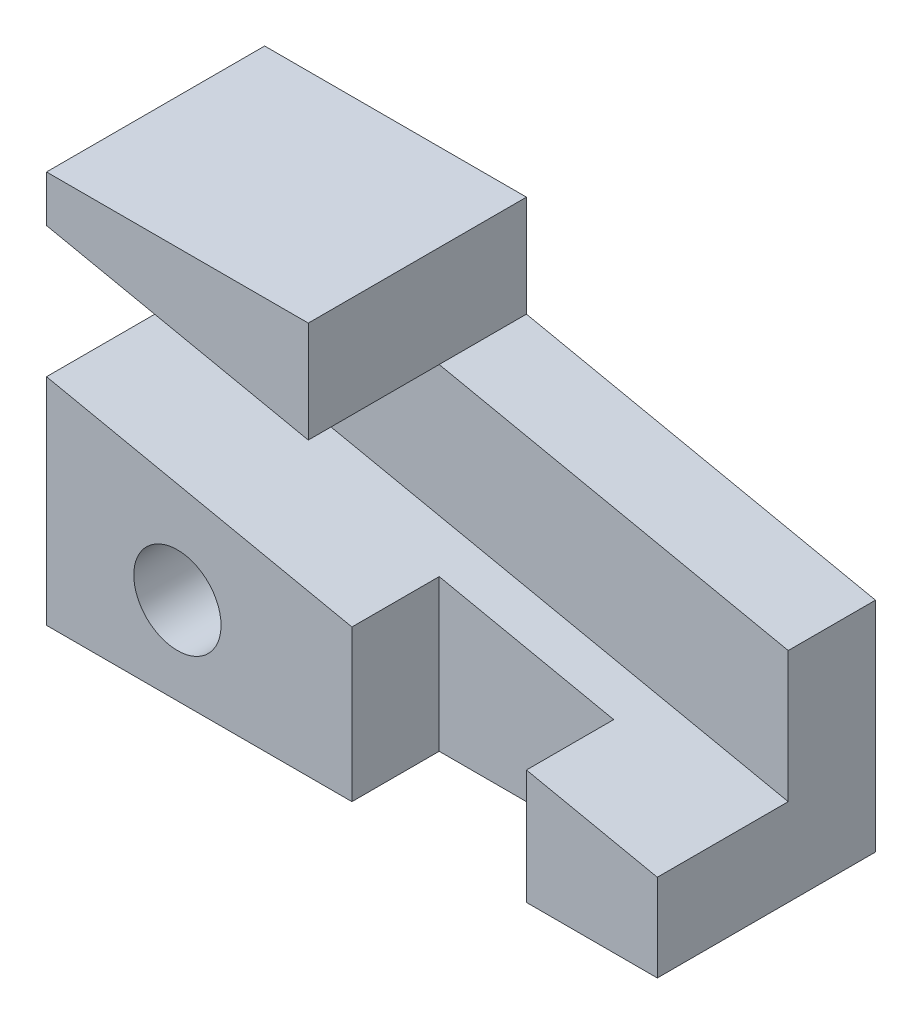
ISO-10303-21;
HEADER;
FILE_DESCRIPTION(('STEP AP214'),'2;1');
FILE_NAME('part.step','',(''),(''),'','','');
FILE_SCHEMA(('AUTOMOTIVE_DESIGN { 1 0 10303 214 1 1 1 1 }'));
ENDSEC;
DATA;
#1=APPLICATION_CONTEXT('core data for automotive mechanical design processes');
#2=APPLICATION_PROTOCOL_DEFINITION('international standard','automotive_design',2000,#1);
#3=PRODUCT_CONTEXT('',#1,'mechanical');
#4=PRODUCT('Part','Part','',(#3));
#5=PRODUCT_RELATED_PRODUCT_CATEGORY('part','',(#4));
#6=PRODUCT_DEFINITION_FORMATION('','',#4);
#7=PRODUCT_DEFINITION_CONTEXT('part definition',#1,'design');
#8=PRODUCT_DEFINITION('design','',#6,#7);
#9=PRODUCT_DEFINITION_SHAPE('','',#8);
#10=(LENGTH_UNIT() NAMED_UNIT(*) SI_UNIT(.MILLI.,.METRE.));
#11=(NAMED_UNIT(*) PLANE_ANGLE_UNIT() SI_UNIT($,.RADIAN.));
#12=(NAMED_UNIT(*) SI_UNIT($,.STERADIAN.) SOLID_ANGLE_UNIT());
#13=UNCERTAINTY_MEASURE_WITH_UNIT(LENGTH_MEASURE(1.E-05),#10,'distance_accuracy_value','');
#14=(GEOMETRIC_REPRESENTATION_CONTEXT(3) GLOBAL_UNCERTAINTY_ASSIGNED_CONTEXT((#13)) GLOBAL_UNIT_ASSIGNED_CONTEXT((#10,
#11,#12)) REPRESENTATION_CONTEXT('',''));
#15=CARTESIAN_POINT('',(0.,0.,0.));
#16=DIRECTION('',(0.,0.,1.));
#17=DIRECTION('',(1.,0.,0.));
#18=AXIS2_PLACEMENT_3D('',#15,#16,#17);
#19=CARTESIAN_POINT('',(0.,45.,0.));
#20=DIRECTION('',(0.,0.,-1.));
#21=DIRECTION('',(-1.,0.,0.));
#22=AXIS2_PLACEMENT_3D('',#19,#20,#21);
#23=PLANE('',#22);
#24=CARTESIAN_POINT('',(15.,10.,0.));
#25=DIRECTION('',(0.,0.,1.));
#26=DIRECTION('',(1.,0.,0.));
#27=AXIS2_PLACEMENT_3D('',#24,#25,#26);
#28=CIRCLE('',#27,5.);
#29=CARTESIAN_POINT('',(20.,10.,0.));
#30=VERTEX_POINT('',#29);
#31=EDGE_CURVE('E465',#30,#30,#28,.T.);
#32=ORIENTED_EDGE('',*,*,#31,.F.);
#33=EDGE_LOOP('',(#32));
#34=FACE_BOUND('',#33,.T.);
#35=DIRECTION('',(1.,0.,0.));
#36=VECTOR('',#35,1.);
#37=CARTESIAN_POINT('',(0.,0.,0.));
#38=LINE('',#37,#36);
#39=CARTESIAN_POINT('',(0.,0.,0.));
#40=VERTEX_POINT('',#39);
#41=CARTESIAN_POINT('',(35.,0.,0.));
#42=VERTEX_POINT('',#41);
#43=EDGE_CURVE('E249',#40,#42,#38,.T.);
#44=ORIENTED_EDGE('',*,*,#43,.T.);
#45=DIRECTION('',(0.,-1.,0.));
#46=VECTOR('',#45,1.);
#47=CARTESIAN_POINT('',(35.,45.,0.));
#48=LINE('',#47,#46);
#49=CARTESIAN_POINT('',(35.,17.3389476948148,0.));
#50=VERTEX_POINT('',#49);
#51=EDGE_CURVE('E152',#50,#42,#48,.T.);
#52=ORIENTED_EDGE('',*,*,#51,.F.);
#53=DIRECTION('',(0.978715612915179,-0.205221219750946,0.));
#54=VECTOR('',#53,1.);
#55=CARTESIAN_POINT('',(0.,24.6778953896296,0.));
#56=LINE('',#55,#54);
#57=CARTESIAN_POINT('',(0.,24.6778953896296,0.));
#58=VERTEX_POINT('',#57);
#59=EDGE_CURVE('E217',#58,#50,#56,.T.);
#60=ORIENTED_EDGE('',*,*,#59,.F.);
#61=DIRECTION('',(0.,-1.,0.));
#62=VECTOR('',#61,1.);
#63=CARTESIAN_POINT('',(0.,45.,0.));
#64=LINE('',#63,#62);
#65=EDGE_CURVE('E268',#58,#40,#64,.T.);
#66=ORIENTED_EDGE('',*,*,#65,.T.);
#67=EDGE_LOOP('',(#44,#52,#60,#66));
#68=FACE_BOUND('',#67,.T.);
#69=ADVANCED_FACE('F39',(#34,#68),#23,.F.);
#70=DIRECTION('',(-0.978715612915179,0.205221219750946,0.));
#71=VECTOR('',#70,1.);
#72=CARTESIAN_POINT('',(70.,25.,0.));
#73=LINE('',#72,#71);
#74=CARTESIAN_POINT('',(30.,33.3873687940741,0.));
#75=VERTEX_POINT('',#74);
#76=CARTESIAN_POINT('',(0.,39.6778953896296,0.));
#77=VERTEX_POINT('',#76);
#78=EDGE_CURVE('E191',#75,#77,#73,.T.);
#79=ORIENTED_EDGE('',*,*,#78,.F.);
#80=DIRECTION('',(0.,-1.,0.));
#81=VECTOR('',#80,1.);
#82=CARTESIAN_POINT('',(30.,45.,0.));
#83=LINE('',#82,#81);
#84=CARTESIAN_POINT('',(30.,45.,0.));
#85=VERTEX_POINT('',#84);
#86=EDGE_CURVE('E169',#85,#75,#83,.T.);
#87=ORIENTED_EDGE('',*,*,#86,.F.);
#88=DIRECTION('',(1.,0.,0.));
#89=VECTOR('',#88,1.);
#90=CARTESIAN_POINT('',(0.,45.,0.));
#91=LINE('',#90,#89);
#92=CARTESIAN_POINT('',(0.,45.,0.));
#93=VERTEX_POINT('',#92);
#94=EDGE_CURVE('E236',#93,#85,#91,.T.);
#95=ORIENTED_EDGE('',*,*,#94,.F.);
#96=EDGE_CURVE('E269',#93,#77,#64,.T.);
#97=ORIENTED_EDGE('',*,*,#96,.T.);
#98=EDGE_LOOP('',(#79,#87,#95,#97));
#99=FACE_BOUND('',#98,.T.);
#100=ADVANCED_FACE('F296',(#99),#23,.F.);
#101=CARTESIAN_POINT('',(0.,45.,0.));
#102=DIRECTION('',(1.,0.,0.));
#103=DIRECTION('',(0.,0.,-1.));
#104=AXIS2_PLACEMENT_3D('',#101,#102,#103);
#105=PLANE('',#104);
#106=DIRECTION('',(0.,-1.,0.));
#107=VECTOR('',#106,1.);
#108=CARTESIAN_POINT('',(0.,39.6778953896296,-15.));
#109=LINE('',#108,#107);
#110=CARTESIAN_POINT('',(0.,39.6778953896296,-15.));
#111=VERTEX_POINT('',#110);
#112=CARTESIAN_POINT('',(0.,24.6778953896296,-15.));
#113=VERTEX_POINT('',#112);
#114=EDGE_CURVE('E201',#111,#113,#109,.T.);
#115=ORIENTED_EDGE('',*,*,#114,.F.);
#116=DIRECTION('',(0.,0.,1.));
#117=VECTOR('',#116,1.);
#118=CARTESIAN_POINT('',(0.,39.6778953896296,-15.));
#119=LINE('',#118,#117);
#120=EDGE_CURVE('E213',#111,#77,#119,.T.);
#121=ORIENTED_EDGE('',*,*,#120,.T.);
#122=ORIENTED_EDGE('',*,*,#96,.F.);
#123=DIRECTION('',(0.,0.,1.));
#124=VECTOR('',#123,1.);
#125=CARTESIAN_POINT('',(0.,45.,0.));
#126=LINE('',#125,#124);
#127=CARTESIAN_POINT('',(0.,45.,-25.));
#128=VERTEX_POINT('',#127);
#129=EDGE_CURVE('E232',#128,#93,#126,.T.);
#130=ORIENTED_EDGE('',*,*,#129,.F.);
#131=DIRECTION('',(0.,-1.,0.));
#132=VECTOR('',#131,1.);
#133=CARTESIAN_POINT('',(0.,45.,-25.));
#134=LINE('',#133,#132);
#135=CARTESIAN_POINT('',(0.,0.,-25.));
#136=VERTEX_POINT('',#135);
#137=EDGE_CURVE('E244',#128,#136,#134,.T.);
#138=ORIENTED_EDGE('',*,*,#137,.T.);
#139=DIRECTION('',(0.,0.,1.));
#140=VECTOR('',#139,1.);
#141=CARTESIAN_POINT('',(0.,0.,0.));
#142=LINE('',#141,#140);
#143=EDGE_CURVE('E225',#136,#40,#142,.T.);
#144=ORIENTED_EDGE('',*,*,#143,.T.);
#145=ORIENTED_EDGE('',*,*,#65,.F.);
#146=DIRECTION('',(0.,0.,1.));
#147=VECTOR('',#146,1.);
#148=CARTESIAN_POINT('',(0.,24.6778953896296,-15.));
#149=LINE('',#148,#147);
#150=EDGE_CURVE('E226',#113,#58,#149,.T.);
#151=ORIENTED_EDGE('',*,*,#150,.F.);
#152=EDGE_LOOP('',(#115,#121,#122,#130,#138,#144,#145,#151));
#153=FACE_BOUND('',#152,.T.);
#154=ADVANCED_FACE('F41',(#153),#105,.F.);
#155=CARTESIAN_POINT('',(55.,13.1452632977778,0.));
#156=VERTEX_POINT('',#155);
#157=CARTESIAN_POINT('',(70.,10.,0.));
#158=VERTEX_POINT('',#157);
#159=EDGE_CURVE('E216',#156,#158,#56,.T.);
#160=ORIENTED_EDGE('',*,*,#159,.F.);
#161=DIRECTION('',(0.,-1.,0.));
#162=VECTOR('',#161,1.);
#163=CARTESIAN_POINT('',(55.,45.,0.));
#164=LINE('',#163,#162);
#165=CARTESIAN_POINT('',(55.,0.,0.));
#166=VERTEX_POINT('',#165);
#167=EDGE_CURVE('E170',#156,#166,#164,.T.);
#168=ORIENTED_EDGE('',*,*,#167,.T.);
#169=CARTESIAN_POINT('',(70.,0.,0.));
#170=VERTEX_POINT('',#169);
#171=EDGE_CURVE('E248',#166,#170,#38,.T.);
#172=ORIENTED_EDGE('',*,*,#171,.T.);
#173=DIRECTION('',(0.,-1.,0.));
#174=VECTOR('',#173,1.);
#175=CARTESIAN_POINT('',(70.,45.,0.));
#176=LINE('',#175,#174);
#177=EDGE_CURVE('E264',#158,#170,#176,.T.);
#178=ORIENTED_EDGE('',*,*,#177,.F.);
#179=EDGE_LOOP('',(#160,#168,#172,#178));
#180=FACE_BOUND('',#179,.T.);
#181=ADVANCED_FACE('F283',(#180),#23,.F.);
#182=CARTESIAN_POINT('',(70.,45.,0.));
#183=DIRECTION('',(-1.,0.,0.));
#184=DIRECTION('',(0.,0.,1.));
#185=AXIS2_PLACEMENT_3D('',#182,#183,#184);
#186=PLANE('',#185);
#187=DIRECTION('',(0.,-1.,0.));
#188=VECTOR('',#187,1.);
#189=CARTESIAN_POINT('',(70.,45.,-25.));
#190=LINE('',#189,#188);
#191=CARTESIAN_POINT('',(70.,25.,-25.));
#192=VERTEX_POINT('',#191);
#193=CARTESIAN_POINT('',(70.,0.,-25.));
#194=VERTEX_POINT('',#193);
#195=EDGE_CURVE('E261',#192,#194,#190,.T.);
#196=ORIENTED_EDGE('',*,*,#195,.F.);
#197=DIRECTION('',(0.,0.,1.));
#198=VECTOR('',#197,1.);
#199=CARTESIAN_POINT('',(70.,25.,-25.));
#200=LINE('',#199,#198);
#201=CARTESIAN_POINT('',(70.,25.,-15.));
#202=VERTEX_POINT('',#201);
#203=EDGE_CURVE('E187',#192,#202,#200,.T.);
#204=ORIENTED_EDGE('',*,*,#203,.T.);
#205=DIRECTION('',(0.,1.,0.));
#206=VECTOR('',#205,1.);
#207=CARTESIAN_POINT('',(70.,10.,-15.));
#208=LINE('',#207,#206);
#209=CARTESIAN_POINT('',(70.,10.,-15.));
#210=VERTEX_POINT('',#209);
#211=EDGE_CURVE('E209',#210,#202,#208,.T.);
#212=ORIENTED_EDGE('',*,*,#211,.F.);
#213=DIRECTION('',(0.,0.,1.));
#214=VECTOR('',#213,1.);
#215=CARTESIAN_POINT('',(70.,10.,-15.));
#216=LINE('',#215,#214);
#217=EDGE_CURVE('E221',#210,#158,#216,.T.);
#218=ORIENTED_EDGE('',*,*,#217,.T.);
#219=ORIENTED_EDGE('',*,*,#177,.T.);
#220=DIRECTION('',(0.,0.,-1.));
#221=VECTOR('',#220,1.);
#222=CARTESIAN_POINT('',(70.,0.,0.));
#223=LINE('',#222,#221);
#224=EDGE_CURVE('E252',#170,#194,#223,.T.);
#225=ORIENTED_EDGE('',*,*,#224,.T.);
#226=EDGE_LOOP('',(#196,#204,#212,#218,#219,#225));
#227=FACE_BOUND('',#226,.T.);
#228=ADVANCED_FACE('F318',(#227),#186,.F.);
#229=CARTESIAN_POINT('',(0.,45.,-25.));
#230=DIRECTION('',(0.,0.,1.));
#231=DIRECTION('',(1.,0.,0.));
#232=AXIS2_PLACEMENT_3D('',#229,#230,#231);
#233=PLANE('',#232);
#234=CARTESIAN_POINT('',(15.,10.,-25.));
#235=DIRECTION('',(0.,0.,1.));
#236=DIRECTION('',(1.,0.,0.));
#237=AXIS2_PLACEMENT_3D('',#234,#235,#236);
#238=CIRCLE('',#237,5.);
#239=CARTESIAN_POINT('',(20.,10.,-25.));
#240=VERTEX_POINT('',#239);
#241=EDGE_CURVE('E157',#240,#240,#238,.T.);
#242=ORIENTED_EDGE('',*,*,#241,.T.);
#243=EDGE_LOOP('',(#242));
#244=FACE_BOUND('',#243,.T.);
#245=DIRECTION('',(0.,-1.,0.));
#246=VECTOR('',#245,1.);
#247=CARTESIAN_POINT('',(30.,45.,-25.));
#248=LINE('',#247,#246);
#249=CARTESIAN_POINT('',(30.,45.,-25.));
#250=VERTEX_POINT('',#249);
#251=CARTESIAN_POINT('',(30.,33.3873687940741,-25.));
#252=VERTEX_POINT('',#251);
#253=EDGE_CURVE('E176',#250,#252,#248,.T.);
#254=ORIENTED_EDGE('',*,*,#253,.T.);
#255=DIRECTION('',(0.978715612915179,-0.205221219750946,0.));
#256=VECTOR('',#255,1.);
#257=CARTESIAN_POINT('',(30.,33.3873687940741,-25.));
#258=LINE('',#257,#256);
#259=EDGE_CURVE('E180',#252,#192,#258,.T.);
#260=ORIENTED_EDGE('',*,*,#259,.T.);
#261=ORIENTED_EDGE('',*,*,#195,.T.);
#262=DIRECTION('',(-1.,0.,0.));
#263=VECTOR('',#262,1.);
#264=CARTESIAN_POINT('',(0.,0.,-25.));
#265=LINE('',#264,#263);
#266=EDGE_CURVE('E237',#194,#136,#265,.T.);
#267=ORIENTED_EDGE('',*,*,#266,.T.);
#268=ORIENTED_EDGE('',*,*,#137,.F.);
#269=DIRECTION('',(-1.,0.,0.));
#270=VECTOR('',#269,1.);
#271=CARTESIAN_POINT('',(0.,45.,-25.));
#272=LINE('',#271,#270);
#273=EDGE_CURVE('E241',#250,#128,#272,.T.);
#274=ORIENTED_EDGE('',*,*,#273,.F.);
#275=EDGE_LOOP('',(#254,#260,#261,#267,#268,#274));
#276=FACE_BOUND('',#275,.T.);
#277=ADVANCED_FACE('F314',(#244,#276),#233,.F.);
#278=CARTESIAN_POINT('',(0.,45.,0.));
#279=DIRECTION('',(0.,-1.,0.));
#280=DIRECTION('',(0.,0.,-1.));
#281=AXIS2_PLACEMENT_3D('',#278,#279,#280);
#282=PLANE('',#281);
#283=ORIENTED_EDGE('',*,*,#94,.T.);
#284=DIRECTION('',(0.,0.,1.));
#285=VECTOR('',#284,1.);
#286=CARTESIAN_POINT('',(30.,45.,-25.));
#287=LINE('',#286,#285);
#288=EDGE_CURVE('E184',#250,#85,#287,.T.);
#289=ORIENTED_EDGE('',*,*,#288,.F.);
#290=ORIENTED_EDGE('',*,*,#273,.T.);
#291=ORIENTED_EDGE('',*,*,#129,.T.);
#292=EDGE_LOOP('',(#283,#289,#290,#291));
#293=FACE_BOUND('',#292,.T.);
#294=ADVANCED_FACE('F324',(#293),#282,.F.);
#295=CARTESIAN_POINT('',(0.,0.,0.));
#296=DIRECTION('',(0.,-1.,0.));
#297=DIRECTION('',(0.,0.,-1.));
#298=AXIS2_PLACEMENT_3D('',#295,#296,#297);
#299=PLANE('',#298);
#300=DIRECTION('',(0.,0.,-1.));
#301=VECTOR('',#300,1.);
#302=CARTESIAN_POINT('',(35.,0.,0.));
#303=LINE('',#302,#301);
#304=CARTESIAN_POINT('',(35.,0.,-9.99999999999999));
#305=VERTEX_POINT('',#304);
#306=EDGE_CURVE('E149',#42,#305,#303,.T.);
#307=ORIENTED_EDGE('',*,*,#306,.F.);
#308=ORIENTED_EDGE('',*,*,#43,.F.);
#309=ORIENTED_EDGE('',*,*,#143,.F.);
#310=ORIENTED_EDGE('',*,*,#266,.F.);
#311=ORIENTED_EDGE('',*,*,#224,.F.);
#312=ORIENTED_EDGE('',*,*,#171,.F.);
#313=DIRECTION('',(0.,0.,1.));
#314=VECTOR('',#313,1.);
#315=CARTESIAN_POINT('',(55.,0.,0.));
#316=LINE('',#315,#314);
#317=CARTESIAN_POINT('',(55.,0.,-9.99999999999999));
#318=VERTEX_POINT('',#317);
#319=EDGE_CURVE('E146',#318,#166,#316,.T.);
#320=ORIENTED_EDGE('',*,*,#319,.F.);
#321=DIRECTION('',(1.,0.,0.));
#322=VECTOR('',#321,1.);
#323=CARTESIAN_POINT('',(35.,0.,-9.99999999999999));
#324=LINE('',#323,#322);
#325=EDGE_CURVE('E140',#305,#318,#324,.T.);
#326=ORIENTED_EDGE('',*,*,#325,.F.);
#327=EDGE_LOOP('',(#307,#308,#309,#310,#311,#312,#320,#326));
#328=FACE_BOUND('',#327,.T.);
#329=ADVANCED_FACE('F159',(#328),#299,.T.);
#330=CARTESIAN_POINT('',(70.,25.,-15.));
#331=DIRECTION('',(0.205221219750946,0.978715612915179,0.));
#332=DIRECTION('',(-0.978715612915179,0.205221219750946,0.));
#333=AXIS2_PLACEMENT_3D('',#330,#331,#332);
#334=PLANE('',#333);
#335=DIRECTION('',(-0.978715612915179,0.205221219750946,0.));
#336=VECTOR('',#335,1.);
#337=CARTESIAN_POINT('',(70.,25.,-15.));
#338=LINE('',#337,#336);
#339=CARTESIAN_POINT('',(30.,33.3873687940741,-15.));
#340=VERTEX_POINT('',#339);
#341=EDGE_CURVE('E202',#340,#111,#338,.T.);
#342=ORIENTED_EDGE('',*,*,#341,.F.);
#343=DIRECTION('',(0.,0.,1.));
#344=VECTOR('',#343,1.);
#345=CARTESIAN_POINT('',(30.,33.3873687940741,-25.));
#346=LINE('',#345,#344);
#347=EDGE_CURVE('E194',#340,#75,#346,.T.);
#348=ORIENTED_EDGE('',*,*,#347,.T.);
#349=ORIENTED_EDGE('',*,*,#78,.T.);
#350=ORIENTED_EDGE('',*,*,#120,.F.);
#351=EDGE_LOOP('',(#342,#348,#349,#350));
#352=FACE_BOUND('',#351,.T.);
#353=ADVANCED_FACE('F291',(#352),#334,.F.);
#354=CARTESIAN_POINT('',(0.,24.6778953896296,-15.));
#355=DIRECTION('',(-0.205221219750946,-0.978715612915179,0.));
#356=DIRECTION('',(0.978715612915179,-0.205221219750946,0.));
#357=AXIS2_PLACEMENT_3D('',#354,#355,#356);
#358=PLANE('',#357);
#359=ORIENTED_EDGE('',*,*,#59,.T.);
#360=DIRECTION('',(0.,0.,-1.));
#361=VECTOR('',#360,1.);
#362=CARTESIAN_POINT('',(35.,17.3389476948148,-15.));
#363=LINE('',#362,#361);
#364=CARTESIAN_POINT('',(35.,17.3389476948148,-9.99999999999999));
#365=VERTEX_POINT('',#364);
#366=EDGE_CURVE('E11',#50,#365,#363,.T.);
#367=ORIENTED_EDGE('',*,*,#366,.T.);
#368=DIRECTION('',(0.978715612915179,-0.205221219750946,0.));
#369=VECTOR('',#368,1.);
#370=CARTESIAN_POINT('',(0.,24.6778953896296,-9.99999999999999));
#371=LINE('',#370,#369);
#372=CARTESIAN_POINT('',(55.,13.1452632977778,-9.99999999999999));
#373=VERTEX_POINT('',#372);
#374=EDGE_CURVE('E143',#365,#373,#371,.T.);
#375=ORIENTED_EDGE('',*,*,#374,.T.);
#376=DIRECTION('',(0.,0.,1.));
#377=VECTOR('',#376,1.);
#378=CARTESIAN_POINT('',(55.,13.1452632977778,-15.));
#379=LINE('',#378,#377);
#380=EDGE_CURVE('E48',#373,#156,#379,.T.);
#381=ORIENTED_EDGE('',*,*,#380,.T.);
#382=ORIENTED_EDGE('',*,*,#159,.T.);
#383=ORIENTED_EDGE('',*,*,#217,.F.);
#384=DIRECTION('',(0.978715612915179,-0.205221219750946,0.));
#385=VECTOR('',#384,1.);
#386=CARTESIAN_POINT('',(0.,24.6778953896296,-15.));
#387=LINE('',#386,#385);
#388=EDGE_CURVE('E206',#113,#210,#387,.T.);
#389=ORIENTED_EDGE('',*,*,#388,.F.);
#390=ORIENTED_EDGE('',*,*,#150,.T.);
#391=EDGE_LOOP('',(#359,#367,#375,#381,#382,#383,#389,#390));
#392=FACE_BOUND('',#391,.T.);
#393=ADVANCED_FACE('F278',(#392),#358,.F.);
#394=CARTESIAN_POINT('',(0.,0.,-15.));
#395=DIRECTION('',(0.,0.,1.));
#396=DIRECTION('',(1.,0.,0.));
#397=AXIS2_PLACEMENT_3D('',#394,#395,#396);
#398=PLANE('',#397);
#399=EDGE_CURVE('E197',#202,#340,#338,.T.);
#400=ORIENTED_EDGE('',*,*,#399,.T.);
#401=ORIENTED_EDGE('',*,*,#341,.T.);
#402=ORIENTED_EDGE('',*,*,#114,.T.);
#403=ORIENTED_EDGE('',*,*,#388,.T.);
#404=ORIENTED_EDGE('',*,*,#211,.T.);
#405=EDGE_LOOP('',(#400,#401,#402,#403,#404));
#406=FACE_BOUND('',#405,.T.);
#407=ADVANCED_FACE('F304',(#406),#398,.T.);
#408=CARTESIAN_POINT('',(30.,33.3873687940741,-25.));
#409=DIRECTION('',(-0.205221219750946,-0.978715612915179,0.));
#410=DIRECTION('',(0.978715612915179,-0.205221219750946,0.));
#411=AXIS2_PLACEMENT_3D('',#408,#409,#410);
#412=PLANE('',#411);
#413=ORIENTED_EDGE('',*,*,#399,.F.);
#414=ORIENTED_EDGE('',*,*,#203,.F.);
#415=ORIENTED_EDGE('',*,*,#259,.F.);
#416=EDGE_CURVE('E63',#252,#340,#346,.T.);
#417=ORIENTED_EDGE('',*,*,#416,.T.);
#418=EDGE_LOOP('',(#413,#414,#415,#417));
#419=FACE_BOUND('',#418,.T.);
#420=ADVANCED_FACE('F320',(#419),#412,.F.);
#421=CARTESIAN_POINT('',(30.,45.,-25.));
#422=DIRECTION('',(-1.,0.,0.));
#423=DIRECTION('',(0.,-1.,0.));
#424=AXIS2_PLACEMENT_3D('',#421,#422,#423);
#425=PLANE('',#424);
#426=ORIENTED_EDGE('',*,*,#86,.T.);
#427=ORIENTED_EDGE('',*,*,#347,.F.);
#428=ORIENTED_EDGE('',*,*,#416,.F.);
#429=ORIENTED_EDGE('',*,*,#253,.F.);
#430=ORIENTED_EDGE('',*,*,#288,.T.);
#431=EDGE_LOOP('',(#426,#427,#428,#429,#430));
#432=FACE_BOUND('',#431,.T.);
#433=ADVANCED_FACE('F322',(#432),#425,.F.);
#434=CARTESIAN_POINT('',(35.,45.,0.));
#435=DIRECTION('',(-1.,0.,0.));
#436=DIRECTION('',(0.,0.,1.));
#437=AXIS2_PLACEMENT_3D('',#434,#435,#436);
#438=PLANE('',#437);
#439=ORIENTED_EDGE('',*,*,#51,.T.);
#440=ORIENTED_EDGE('',*,*,#306,.T.);
#441=DIRECTION('',(0.,-1.,0.));
#442=VECTOR('',#441,1.);
#443=CARTESIAN_POINT('',(35.,45.,-9.99999999999999));
#444=LINE('',#443,#442);
#445=EDGE_CURVE('E136',#365,#305,#444,.T.);
#446=ORIENTED_EDGE('',*,*,#445,.F.);
#447=ORIENTED_EDGE('',*,*,#366,.F.);
#448=EDGE_LOOP('',(#439,#440,#446,#447));
#449=FACE_BOUND('',#448,.T.);
#450=ADVANCED_FACE('F150',(#449),#438,.F.);
#451=CARTESIAN_POINT('',(55.,45.,0.));
#452=DIRECTION('',(1.,0.,0.));
#453=DIRECTION('',(0.,0.,-1.));
#454=AXIS2_PLACEMENT_3D('',#451,#452,#453);
#455=PLANE('',#454);
#456=DIRECTION('',(0.,-1.,0.));
#457=VECTOR('',#456,1.);
#458=CARTESIAN_POINT('',(55.,45.,-9.99999999999999));
#459=LINE('',#458,#457);
#460=EDGE_CURVE('E55',#373,#318,#459,.T.);
#461=ORIENTED_EDGE('',*,*,#460,.T.);
#462=ORIENTED_EDGE('',*,*,#319,.T.);
#463=ORIENTED_EDGE('',*,*,#167,.F.);
#464=ORIENTED_EDGE('',*,*,#380,.F.);
#465=EDGE_LOOP('',(#461,#462,#463,#464));
#466=FACE_BOUND('',#465,.T.);
#467=ADVANCED_FACE('F423',(#466),#455,.F.);
#468=CARTESIAN_POINT('',(35.,45.,-9.99999999999999));
#469=DIRECTION('',(0.,0.,-1.));
#470=DIRECTION('',(-1.,0.,0.));
#471=AXIS2_PLACEMENT_3D('',#468,#469,#470);
#472=PLANE('',#471);
#473=ORIENTED_EDGE('',*,*,#445,.T.);
#474=ORIENTED_EDGE('',*,*,#325,.T.);
#475=ORIENTED_EDGE('',*,*,#460,.F.);
#476=ORIENTED_EDGE('',*,*,#374,.F.);
#477=EDGE_LOOP('',(#473,#474,#475,#476));
#478=FACE_BOUND('',#477,.T.);
#479=ADVANCED_FACE('F138',(#478),#472,.F.);
#480=CARTESIAN_POINT('',(15.,10.,-25.));
#481=DIRECTION('',(0.,0.,1.));
#482=DIRECTION('',(1.,0.,0.));
#483=AXIS2_PLACEMENT_3D('',#480,#481,#482);
#484=CYLINDRICAL_SURFACE('',#483,5.);
#485=ORIENTED_EDGE('',*,*,#241,.F.);
#486=EDGE_LOOP('',(#485));
#487=FACE_BOUND('',#486,.T.);
#488=ORIENTED_EDGE('',*,*,#31,.T.);
#489=EDGE_LOOP('',(#488));
#490=FACE_BOUND('',#489,.T.);
#491=ADVANCED_FACE('F439',(#487,#490),#484,.F.);
#492=CLOSED_SHELL('',(#69,#100,#154,#181,#228,#277,#294,#329,#353,#393,#407,#420,#433,#450,#467,
#479,#491));
#493=MANIFOLD_SOLID_BREP('B2',#492);
#494=ADVANCED_BREP_SHAPE_REPRESENTATION('',(#18,#493),#14);
#495=SHAPE_DEFINITION_REPRESENTATION(#9,#494);
ENDSEC;
END-ISO-10303-21;
